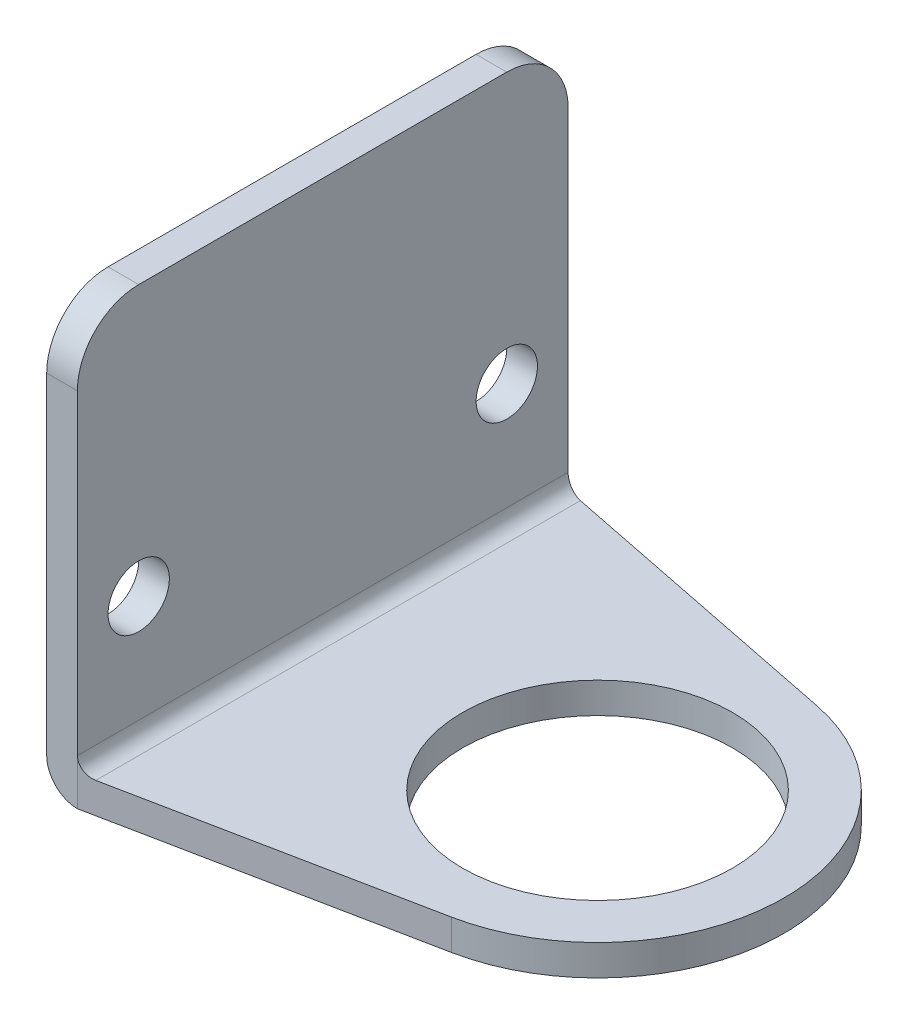
ISO-10303-21;
HEADER;
FILE_DESCRIPTION(('STEP AP214'),'2;1');
FILE_NAME('part.step','',(''),(''),'','','');
FILE_SCHEMA(('AUTOMOTIVE_DESIGN { 1 0 10303 214 1 1 1 1 }'));
ENDSEC;
DATA;
#1=APPLICATION_CONTEXT('core data for automotive mechanical design processes');
#2=APPLICATION_PROTOCOL_DEFINITION('international standard','automotive_design',2000,#1);
#3=PRODUCT_CONTEXT('',#1,'mechanical');
#4=PRODUCT('Part','Part','',(#3));
#5=PRODUCT_RELATED_PRODUCT_CATEGORY('part','',(#4));
#6=PRODUCT_DEFINITION_FORMATION('','',#4);
#7=PRODUCT_DEFINITION_CONTEXT('part definition',#1,'design');
#8=PRODUCT_DEFINITION('design','',#6,#7);
#9=PRODUCT_DEFINITION_SHAPE('','',#8);
#10=(LENGTH_UNIT() NAMED_UNIT(*) SI_UNIT(.MILLI.,.METRE.));
#11=(NAMED_UNIT(*) PLANE_ANGLE_UNIT() SI_UNIT($,.RADIAN.));
#12=(NAMED_UNIT(*) SI_UNIT($,.STERADIAN.) SOLID_ANGLE_UNIT());
#13=UNCERTAINTY_MEASURE_WITH_UNIT(LENGTH_MEASURE(1.E-05),#10,'distance_accuracy_value','');
#14=(GEOMETRIC_REPRESENTATION_CONTEXT(3) GLOBAL_UNCERTAINTY_ASSIGNED_CONTEXT((#13)) GLOBAL_UNIT_ASSIGNED_CONTEXT((#10,
#11,#12)) REPRESENTATION_CONTEXT('',''));
#15=CARTESIAN_POINT('',(0.,0.,0.));
#16=DIRECTION('',(0.,0.,1.));
#17=DIRECTION('',(1.,0.,0.));
#18=AXIS2_PLACEMENT_3D('',#15,#16,#17);
#19=CARTESIAN_POINT('',(0.,3.175,0.));
#20=DIRECTION('',(0.,1.,0.));
#21=DIRECTION('',(0.,0.,1.));
#22=AXIS2_PLACEMENT_3D('',#19,#20,#21);
#23=PLANE('',#22);
#24=CARTESIAN_POINT('',(0.,3.175,0.));
#25=DIRECTION('',(0.,1.,0.));
#26=DIRECTION('',(0.,0.,1.));
#27=AXIS2_PLACEMENT_3D('',#24,#25,#26);
#28=CIRCLE('',#27,13.97);
#29=CARTESIAN_POINT('',(0.,3.175,13.97));
#30=VERTEX_POINT('',#29);
#31=EDGE_CURVE('E238',#30,#30,#28,.T.);
#32=ORIENTED_EDGE('',*,*,#31,.F.);
#33=EDGE_LOOP('',(#32));
#34=FACE_BOUND('',#33,.T.);
#35=DIRECTION('',(0.980439451489967,0.,0.196820938830328));
#36=VECTOR('',#35,1.);
#37=CARTESIAN_POINT('',(3.79943140318066,3.175,-18.9264031715623));
#38=LINE('',#37,#36);
#39=CARTESIAN_POINT('',(-26.8605,3.175,-25.0813130684222));
#40=VERTEX_POINT('',#39);
#41=CARTESIAN_POINT('',(3.79943140318065,3.175,-18.9264031715623));
#42=VERTEX_POINT('',#41);
#43=EDGE_CURVE('E141',#40,#42,#38,.T.);
#44=ORIENTED_EDGE('',*,*,#43,.F.);
#45=DIRECTION('',(0.,0.,1.));
#46=VECTOR('',#45,1.);
#47=CARTESIAN_POINT('',(-26.8605,3.175,25.4));
#48=LINE('',#47,#46);
#49=CARTESIAN_POINT('',(-26.8605,3.175,25.0813130684222));
#50=VERTEX_POINT('',#49);
#51=EDGE_CURVE('E126',#40,#50,#48,.T.);
#52=ORIENTED_EDGE('',*,*,#51,.T.);
#53=DIRECTION('',(0.980439451489967,0.,-0.196820938830328));
#54=VECTOR('',#53,1.);
#55=CARTESIAN_POINT('',(3.79943140318065,3.175,18.9264031715623));
#56=LINE('',#55,#54);
#57=CARTESIAN_POINT('',(3.79943140318066,3.175,18.9264031715623));
#58=VERTEX_POINT('',#57);
#59=EDGE_CURVE('E120',#50,#58,#56,.T.);
#60=ORIENTED_EDGE('',*,*,#59,.T.);
#61=CARTESIAN_POINT('',(0.,3.175,0.));
#62=DIRECTION('',(0.,1.,0.));
#63=DIRECTION('',(0.,0.,1.));
#64=AXIS2_PLACEMENT_3D('',#61,#62,#63);
#65=CIRCLE('',#64,19.304);
#66=EDGE_CURVE('E123',#58,#42,#65,.T.);
#67=ORIENTED_EDGE('',*,*,#66,.T.);
#68=EDGE_LOOP('',(#44,#52,#60,#67));
#69=FACE_BOUND('',#68,.T.);
#70=ADVANCED_FACE('F41',(#34,#69),#23,.T.);
#71=CARTESIAN_POINT('',(3.79943140318065,3.175,18.9264031715623));
#72=DIRECTION('',(-0.196820938830328,0.,-0.980439451489967));
#73=DIRECTION('',(-0.980439451489967,0.,0.196820938830328));
#74=AXIS2_PLACEMENT_3D('',#71,#72,#73);
#75=PLANE('',#74);
#76=DIRECTION('',(0.980439451489967,0.,-0.196820938830328));
#77=VECTOR('',#76,1.);
#78=CARTESIAN_POINT('',(3.79943140318065,0.,18.9264031715623));
#79=LINE('',#78,#77);
#80=CARTESIAN_POINT('',(-28.448,0.,25.4));
#81=VERTEX_POINT('',#80);
#82=CARTESIAN_POINT('',(3.79943140318066,0.,18.9264031715623));
#83=VERTEX_POINT('',#82);
#84=EDGE_CURVE('E146',#81,#83,#79,.T.);
#85=ORIENTED_EDGE('',*,*,#84,.T.);
#86=DIRECTION('',(0.,-1.,0.));
#87=VECTOR('',#86,1.);
#88=CARTESIAN_POINT('',(3.79943140318066,3.175,18.9264031715623));
#89=LINE('',#88,#87);
#90=EDGE_CURVE('E137',#58,#83,#89,.T.);
#91=ORIENTED_EDGE('',*,*,#90,.F.);
#92=ORIENTED_EDGE('',*,*,#59,.F.);
#93=CARTESIAN_POINT('',(-26.8605,4.7625,25.0813130684222));
#94=DIRECTION('',(-0.196820938830328,0.,-0.980439451489967));
#95=DIRECTION('',(0.980439451489967,0.,-0.196820938830328));
#96=AXIS2_PLACEMENT_3D('',#93,#94,#95);
#97=ELLIPSE('',#96,1.61917189030642,1.5875);
#98=CARTESIAN_POINT('',(-28.448,4.7625,25.4));
#99=VERTEX_POINT('',#98);
#100=EDGE_CURVE('E160',#50,#99,#97,.T.);
#101=ORIENTED_EDGE('',*,*,#100,.T.);
#102=DIRECTION('',(0.,-1.,0.));
#103=VECTOR('',#102,1.);
#104=CARTESIAN_POINT('',(-28.448,3.175,25.4));
#105=LINE('',#104,#103);
#106=EDGE_CURVE('E228',#99,#81,#105,.T.);
#107=ORIENTED_EDGE('',*,*,#106,.T.);
#108=EDGE_LOOP('',(#85,#91,#92,#101,#107));
#109=FACE_BOUND('',#108,.T.);
#110=ADVANCED_FACE('F143',(#109),#75,.F.);
#111=CARTESIAN_POINT('',(0.,3.175,0.));
#112=DIRECTION('',(0.,-1.,0.));
#113=DIRECTION('',(0.,0.,-1.));
#114=AXIS2_PLACEMENT_3D('',#111,#112,#113);
#115=CYLINDRICAL_SURFACE('',#114,19.304);
#116=CARTESIAN_POINT('',(0.,0.,0.));
#117=DIRECTION('',(0.,1.,0.));
#118=DIRECTION('',(0.,0.,1.));
#119=AXIS2_PLACEMENT_3D('',#116,#117,#118);
#120=CIRCLE('',#119,19.304);
#121=CARTESIAN_POINT('',(3.79943140318065,0.,-18.9264031715623));
#122=VERTEX_POINT('',#121);
#123=EDGE_CURVE('E244',#83,#122,#120,.T.);
#124=ORIENTED_EDGE('',*,*,#123,.T.);
#125=DIRECTION('',(0.,-1.,0.));
#126=VECTOR('',#125,1.);
#127=CARTESIAN_POINT('',(3.79943140318065,3.175,-18.9264031715623));
#128=LINE('',#127,#126);
#129=EDGE_CURVE('E139',#42,#122,#128,.T.);
#130=ORIENTED_EDGE('',*,*,#129,.F.);
#131=ORIENTED_EDGE('',*,*,#66,.F.);
#132=ORIENTED_EDGE('',*,*,#90,.T.);
#133=EDGE_LOOP('',(#124,#130,#131,#132));
#134=FACE_BOUND('',#133,.T.);
#135=ADVANCED_FACE('F136',(#134),#115,.T.);
#136=CARTESIAN_POINT('',(3.79943140318066,3.175,-18.9264031715623));
#137=DIRECTION('',(0.196820938830328,0.,-0.980439451489967));
#138=DIRECTION('',(-0.980439451489968,0.,-0.196820938830328));
#139=AXIS2_PLACEMENT_3D('',#136,#137,#138);
#140=PLANE('',#139);
#141=DIRECTION('',(0.980439451489967,0.,0.196820938830328));
#142=VECTOR('',#141,1.);
#143=CARTESIAN_POINT('',(3.79943140318066,0.,-18.9264031715623));
#144=LINE('',#143,#142);
#145=CARTESIAN_POINT('',(-28.448,0.,-25.4));
#146=VERTEX_POINT('',#145);
#147=EDGE_CURVE('E247',#146,#122,#144,.T.);
#148=ORIENTED_EDGE('',*,*,#147,.F.);
#149=DIRECTION('',(0.,-1.,0.));
#150=VECTOR('',#149,1.);
#151=CARTESIAN_POINT('',(-28.448,3.175,-25.4));
#152=LINE('',#151,#150);
#153=CARTESIAN_POINT('',(-28.448,4.7625,-25.4));
#154=VERTEX_POINT('',#153);
#155=EDGE_CURVE('E153',#154,#146,#152,.T.);
#156=ORIENTED_EDGE('',*,*,#155,.F.);
#157=CARTESIAN_POINT('',(-26.8605,4.7625,-25.0813130684222));
#158=DIRECTION('',(0.196820938830328,0.,-0.980439451489967));
#159=DIRECTION('',(-0.980439451489968,0.,-0.196820938830328));
#160=AXIS2_PLACEMENT_3D('',#157,#158,#159);
#161=ELLIPSE('',#160,1.61917189030642,1.5875);
#162=EDGE_CURVE('E163',#154,#40,#161,.F.);
#163=ORIENTED_EDGE('',*,*,#162,.T.);
#164=ORIENTED_EDGE('',*,*,#43,.T.);
#165=ORIENTED_EDGE('',*,*,#129,.T.);
#166=EDGE_LOOP('',(#148,#156,#163,#164,#165));
#167=FACE_BOUND('',#166,.T.);
#168=ADVANCED_FACE('F270',(#167),#140,.T.);
#169=CARTESIAN_POINT('',(0.,3.175,-25.4));
#170=DIRECTION('',(0.,0.,1.));
#171=DIRECTION('',(1.,0.,0.));
#172=AXIS2_PLACEMENT_3D('',#169,#170,#171);
#173=PLANE('',#172);
#174=DIRECTION('',(0.,-1.,0.));
#175=VECTOR('',#174,1.);
#176=CARTESIAN_POINT('',(-31.623,3.175,-25.4));
#177=LINE('',#176,#175);
#178=CARTESIAN_POINT('',(-31.623,37.465,-25.4));
#179=VERTEX_POINT('',#178);
#180=CARTESIAN_POINT('',(-31.623,3.175,-25.4));
#181=VERTEX_POINT('',#180);
#182=EDGE_CURVE('E258',#179,#181,#177,.T.);
#183=ORIENTED_EDGE('',*,*,#182,.F.);
#184=DIRECTION('',(-1.,0.,0.));
#185=VECTOR('',#184,1.);
#186=CARTESIAN_POINT('',(-28.448,37.465,-25.4));
#187=LINE('',#186,#185);
#188=CARTESIAN_POINT('',(-28.448,37.465,-25.4));
#189=VERTEX_POINT('',#188);
#190=EDGE_CURVE('E11',#179,#189,#187,.F.);
#191=ORIENTED_EDGE('',*,*,#190,.T.);
#192=DIRECTION('',(0.,-1.,0.));
#193=VECTOR('',#192,1.);
#194=CARTESIAN_POINT('',(-28.448,43.815,-25.4));
#195=LINE('',#194,#193);
#196=EDGE_CURVE('E230',#189,#154,#195,.T.);
#197=ORIENTED_EDGE('',*,*,#196,.T.);
#198=ORIENTED_EDGE('',*,*,#155,.T.);
#199=CARTESIAN_POINT('',(-28.448,3.175,-25.4));
#200=DIRECTION('',(0.,0.,1.));
#201=DIRECTION('',(1.,0.,0.));
#202=AXIS2_PLACEMENT_3D('',#199,#200,#201);
#203=CIRCLE('',#202,3.175);
#204=EDGE_CURVE('E176',#146,#181,#203,.F.);
#205=ORIENTED_EDGE('',*,*,#204,.T.);
#206=EDGE_LOOP('',(#183,#191,#197,#198,#205));
#207=FACE_BOUND('',#206,.T.);
#208=ADVANCED_FACE('F265',(#207),#173,.F.);
#209=CARTESIAN_POINT('',(-31.623,3.175,0.));
#210=DIRECTION('',(1.,0.,0.));
#211=DIRECTION('',(0.,0.,-1.));
#212=AXIS2_PLACEMENT_3D('',#209,#210,#211);
#213=PLANE('',#212);
#214=CARTESIAN_POINT('',(-31.623,15.875,19.05));
#215=DIRECTION('',(-1.,0.,0.));
#216=DIRECTION('',(0.,0.,1.));
#217=AXIS2_PLACEMENT_3D('',#214,#215,#216);
#218=CIRCLE('',#217,3.175);
#219=CARTESIAN_POINT('',(-31.623,15.875,22.225));
#220=VERTEX_POINT('',#219);
#221=EDGE_CURVE('E186',#220,#220,#218,.T.);
#222=ORIENTED_EDGE('',*,*,#221,.F.);
#223=EDGE_LOOP('',(#222));
#224=FACE_BOUND('',#223,.T.);
#225=CARTESIAN_POINT('',(-31.623,15.875,-19.05));
#226=DIRECTION('',(-1.,0.,0.));
#227=DIRECTION('',(0.,0.,1.));
#228=AXIS2_PLACEMENT_3D('',#225,#226,#227);
#229=CIRCLE('',#228,3.175);
#230=CARTESIAN_POINT('',(-31.623,15.875,-15.875));
#231=VERTEX_POINT('',#230);
#232=EDGE_CURVE('E281',#231,#231,#229,.T.);
#233=ORIENTED_EDGE('',*,*,#232,.F.);
#234=EDGE_LOOP('',(#233));
#235=FACE_BOUND('',#234,.T.);
#236=DIRECTION('',(0.,-1.,0.));
#237=VECTOR('',#236,1.);
#238=CARTESIAN_POINT('',(-31.623,3.175,25.4));
#239=LINE('',#238,#237);
#240=CARTESIAN_POINT('',(-31.623,37.465,25.4));
#241=VERTEX_POINT('',#240);
#242=CARTESIAN_POINT('',(-31.623,3.175,25.4));
#243=VERTEX_POINT('',#242);
#244=EDGE_CURVE('E212',#241,#243,#239,.T.);
#245=ORIENTED_EDGE('',*,*,#244,.F.);
#246=CARTESIAN_POINT('',(-31.623,37.465,19.05));
#247=DIRECTION('',(1.,0.,0.));
#248=DIRECTION('',(0.,0.,-1.));
#249=AXIS2_PLACEMENT_3D('',#246,#247,#248);
#250=CIRCLE('',#249,6.35);
#251=CARTESIAN_POINT('',(-31.623,43.815,19.05));
#252=VERTEX_POINT('',#251);
#253=EDGE_CURVE('E50',#241,#252,#250,.F.);
#254=ORIENTED_EDGE('',*,*,#253,.T.);
#255=DIRECTION('',(0.,0.,1.));
#256=VECTOR('',#255,1.);
#257=CARTESIAN_POINT('',(-31.623,43.815,0.));
#258=LINE('',#257,#256);
#259=CARTESIAN_POINT('',(-31.623,43.815,-19.05));
#260=VERTEX_POINT('',#259);
#261=EDGE_CURVE('E211',#260,#252,#258,.T.);
#262=ORIENTED_EDGE('',*,*,#261,.F.);
#263=CARTESIAN_POINT('',(-31.623,37.465,-19.05));
#264=DIRECTION('',(1.,0.,0.));
#265=DIRECTION('',(0.,0.,-1.));
#266=AXIS2_PLACEMENT_3D('',#263,#264,#265);
#267=CIRCLE('',#266,6.35);
#268=EDGE_CURVE('E57',#260,#179,#267,.F.);
#269=ORIENTED_EDGE('',*,*,#268,.T.);
#270=ORIENTED_EDGE('',*,*,#182,.T.);
#271=DIRECTION('',(0.,0.,1.));
#272=VECTOR('',#271,1.);
#273=CARTESIAN_POINT('',(-31.623,3.175,0.));
#274=LINE('',#273,#272);
#275=EDGE_CURVE('E166',#181,#243,#274,.T.);
#276=ORIENTED_EDGE('',*,*,#275,.T.);
#277=EDGE_LOOP('',(#245,#254,#262,#269,#270,#276));
#278=FACE_BOUND('',#277,.T.);
#279=ADVANCED_FACE('F210',(#224,#235,#278),#213,.F.);
#280=CARTESIAN_POINT('',(0.,3.175,25.4));
#281=DIRECTION('',(0.,0.,1.));
#282=DIRECTION('',(1.,0.,0.));
#283=AXIS2_PLACEMENT_3D('',#280,#281,#282);
#284=PLANE('',#283);
#285=DIRECTION('',(0.,-1.,0.));
#286=VECTOR('',#285,1.);
#287=CARTESIAN_POINT('',(-28.448,43.815,25.4));
#288=LINE('',#287,#286);
#289=CARTESIAN_POINT('',(-28.448,37.465,25.4));
#290=VERTEX_POINT('',#289);
#291=EDGE_CURVE('E221',#290,#99,#288,.T.);
#292=ORIENTED_EDGE('',*,*,#291,.F.);
#293=DIRECTION('',(1.,0.,0.));
#294=VECTOR('',#293,1.);
#295=CARTESIAN_POINT('',(0.,37.465,25.4));
#296=LINE('',#295,#294);
#297=EDGE_CURVE('E65',#290,#241,#296,.F.);
#298=ORIENTED_EDGE('',*,*,#297,.T.);
#299=ORIENTED_EDGE('',*,*,#244,.T.);
#300=CARTESIAN_POINT('',(-28.448,3.175,25.4));
#301=DIRECTION('',(0.,0.,1.));
#302=DIRECTION('',(1.,0.,0.));
#303=AXIS2_PLACEMENT_3D('',#300,#301,#302);
#304=CIRCLE('',#303,3.175);
#305=EDGE_CURVE('E170',#243,#81,#304,.T.);
#306=ORIENTED_EDGE('',*,*,#305,.T.);
#307=ORIENTED_EDGE('',*,*,#106,.F.);
#308=EDGE_LOOP('',(#292,#298,#299,#306,#307));
#309=FACE_BOUND('',#308,.T.);
#310=ADVANCED_FACE('F227',(#309),#284,.T.);
#311=CARTESIAN_POINT('',(0.,3.175,0.));
#312=DIRECTION('',(0.,-1.,0.));
#313=DIRECTION('',(0.,0.,-1.));
#314=AXIS2_PLACEMENT_3D('',#311,#312,#313);
#315=CYLINDRICAL_SURFACE('',#314,13.97);
#316=ORIENTED_EDGE('',*,*,#31,.T.);
#317=EDGE_LOOP('',(#316));
#318=FACE_BOUND('',#317,.T.);
#319=CARTESIAN_POINT('',(0.,0.,0.));
#320=DIRECTION('',(0.,1.,0.));
#321=DIRECTION('',(0.,0.,1.));
#322=AXIS2_PLACEMENT_3D('',#319,#320,#321);
#323=CIRCLE('',#322,13.97);
#324=CARTESIAN_POINT('',(0.,0.,13.97));
#325=VERTEX_POINT('',#324);
#326=EDGE_CURVE('E131',#325,#325,#323,.T.);
#327=ORIENTED_EDGE('',*,*,#326,.F.);
#328=EDGE_LOOP('',(#327));
#329=FACE_BOUND('',#328,.T.);
#330=ADVANCED_FACE('F322',(#318,#329),#315,.F.);
#331=CARTESIAN_POINT('',(0.,0.,0.));
#332=DIRECTION('',(0.,1.,0.));
#333=DIRECTION('',(0.,0.,1.));
#334=AXIS2_PLACEMENT_3D('',#331,#332,#333);
#335=PLANE('',#334);
#336=ORIENTED_EDGE('',*,*,#84,.F.);
#337=DIRECTION('',(0.,0.,1.));
#338=VECTOR('',#337,1.);
#339=CARTESIAN_POINT('',(-28.448,0.,0.));
#340=LINE('',#339,#338);
#341=EDGE_CURVE('E173',#81,#146,#340,.F.);
#342=ORIENTED_EDGE('',*,*,#341,.T.);
#343=ORIENTED_EDGE('',*,*,#147,.T.);
#344=ORIENTED_EDGE('',*,*,#123,.F.);
#345=EDGE_LOOP('',(#336,#342,#343,#344));
#346=FACE_BOUND('',#345,.T.);
#347=ORIENTED_EDGE('',*,*,#326,.T.);
#348=EDGE_LOOP('',(#347));
#349=FACE_BOUND('',#348,.T.);
#350=ADVANCED_FACE('F319',(#346,#349),#335,.F.);
#351=CARTESIAN_POINT('',(-28.448,43.815,0.));
#352=DIRECTION('',(1.,0.,0.));
#353=DIRECTION('',(0.,0.,-1.));
#354=AXIS2_PLACEMENT_3D('',#351,#352,#353);
#355=PLANE('',#354);
#356=CARTESIAN_POINT('',(-28.448,15.875,19.05));
#357=DIRECTION('',(1.,0.,0.));
#358=DIRECTION('',(0.,0.,-1.));
#359=AXIS2_PLACEMENT_3D('',#356,#357,#358);
#360=CIRCLE('',#359,3.175);
#361=CARTESIAN_POINT('',(-28.448,15.875,15.875));
#362=VERTEX_POINT('',#361);
#363=EDGE_CURVE('E185',#362,#362,#360,.T.);
#364=ORIENTED_EDGE('',*,*,#363,.F.);
#365=EDGE_LOOP('',(#364));
#366=FACE_BOUND('',#365,.T.);
#367=CARTESIAN_POINT('',(-28.448,15.875,-19.05));
#368=DIRECTION('',(1.,0.,0.));
#369=DIRECTION('',(0.,0.,-1.));
#370=AXIS2_PLACEMENT_3D('',#367,#368,#369);
#371=CIRCLE('',#370,3.175);
#372=CARTESIAN_POINT('',(-28.448,15.875,-22.225));
#373=VERTEX_POINT('',#372);
#374=EDGE_CURVE('E181',#373,#373,#371,.T.);
#375=ORIENTED_EDGE('',*,*,#374,.F.);
#376=EDGE_LOOP('',(#375));
#377=FACE_BOUND('',#376,.T.);
#378=DIRECTION('',(0.,0.,1.));
#379=VECTOR('',#378,1.);
#380=CARTESIAN_POINT('',(-28.448,43.815,0.));
#381=LINE('',#380,#379);
#382=CARTESIAN_POINT('',(-28.448,43.815,-19.05));
#383=VERTEX_POINT('',#382);
#384=CARTESIAN_POINT('',(-28.448,43.815,19.05));
#385=VERTEX_POINT('',#384);
#386=EDGE_CURVE('E190',#383,#385,#381,.T.);
#387=ORIENTED_EDGE('',*,*,#386,.T.);
#388=CARTESIAN_POINT('',(-28.448,37.465,19.05));
#389=DIRECTION('',(1.,0.,0.));
#390=DIRECTION('',(0.,0.,-1.));
#391=AXIS2_PLACEMENT_3D('',#388,#389,#390);
#392=CIRCLE('',#391,6.35);
#393=EDGE_CURVE('E201',#385,#290,#392,.T.);
#394=ORIENTED_EDGE('',*,*,#393,.T.);
#395=ORIENTED_EDGE('',*,*,#291,.T.);
#396=DIRECTION('',(0.,0.,1.));
#397=VECTOR('',#396,1.);
#398=CARTESIAN_POINT('',(-28.448,4.7625,-25.4));
#399=LINE('',#398,#397);
#400=EDGE_CURVE('E151',#99,#154,#399,.F.);
#401=ORIENTED_EDGE('',*,*,#400,.T.);
#402=ORIENTED_EDGE('',*,*,#196,.F.);
#403=CARTESIAN_POINT('',(-28.448,37.465,-19.05));
#404=DIRECTION('',(1.,0.,0.));
#405=DIRECTION('',(0.,0.,-1.));
#406=AXIS2_PLACEMENT_3D('',#403,#404,#405);
#407=CIRCLE('',#406,6.35);
#408=EDGE_CURVE('E198',#189,#383,#407,.T.);
#409=ORIENTED_EDGE('',*,*,#408,.T.);
#410=EDGE_LOOP('',(#387,#394,#395,#401,#402,#409));
#411=FACE_BOUND('',#410,.T.);
#412=ADVANCED_FACE('F225',(#366,#377,#411),#355,.T.);
#413=CARTESIAN_POINT('',(0.,43.815,0.));
#414=DIRECTION('',(0.,1.,0.));
#415=DIRECTION('',(0.,0.,1.));
#416=AXIS2_PLACEMENT_3D('',#413,#414,#415);
#417=PLANE('',#416);
#418=ORIENTED_EDGE('',*,*,#261,.T.);
#419=DIRECTION('',(1.,0.,0.));
#420=VECTOR('',#419,1.);
#421=CARTESIAN_POINT('',(0.,43.815,19.05));
#422=LINE('',#421,#420);
#423=EDGE_CURVE('E194',#252,#385,#422,.T.);
#424=ORIENTED_EDGE('',*,*,#423,.T.);
#425=ORIENTED_EDGE('',*,*,#386,.F.);
#426=DIRECTION('',(-1.,0.,0.));
#427=VECTOR('',#426,1.);
#428=CARTESIAN_POINT('',(-31.623,43.815,-19.05));
#429=LINE('',#428,#427);
#430=EDGE_CURVE('E180',#383,#260,#429,.T.);
#431=ORIENTED_EDGE('',*,*,#430,.T.);
#432=EDGE_LOOP('',(#418,#424,#425,#431));
#433=FACE_BOUND('',#432,.T.);
#434=ADVANCED_FACE('F216',(#433),#417,.T.);
#435=CARTESIAN_POINT('',(-26.8605,4.7625,0.));
#436=DIRECTION('',(0.,0.,-1.));
#437=DIRECTION('',(-1.,0.,0.));
#438=AXIS2_PLACEMENT_3D('',#435,#436,#437);
#439=CYLINDRICAL_SURFACE('',#438,1.5875);
#440=ORIENTED_EDGE('',*,*,#162,.F.);
#441=ORIENTED_EDGE('',*,*,#400,.F.);
#442=ORIENTED_EDGE('',*,*,#100,.F.);
#443=ORIENTED_EDGE('',*,*,#51,.F.);
#444=EDGE_LOOP('',(#440,#441,#442,#443));
#445=FACE_BOUND('',#444,.T.);
#446=ADVANCED_FACE('F306',(#445),#439,.F.);
#447=CARTESIAN_POINT('',(-28.448,3.175,0.));
#448=DIRECTION('',(0.,0.,1.));
#449=DIRECTION('',(1.,0.,0.));
#450=AXIS2_PLACEMENT_3D('',#447,#448,#449);
#451=CYLINDRICAL_SURFACE('',#450,3.175);
#452=ORIENTED_EDGE('',*,*,#204,.F.);
#453=ORIENTED_EDGE('',*,*,#341,.F.);
#454=ORIENTED_EDGE('',*,*,#305,.F.);
#455=ORIENTED_EDGE('',*,*,#275,.F.);
#456=EDGE_LOOP('',(#452,#453,#454,#455));
#457=FACE_BOUND('',#456,.T.);
#458=ADVANCED_FACE('F274',(#457),#451,.T.);
#459=CARTESIAN_POINT('',(19.304,15.875,-19.05));
#460=DIRECTION('',(-1.,0.,0.));
#461=DIRECTION('',(0.,0.,1.));
#462=AXIS2_PLACEMENT_3D('',#459,#460,#461);
#463=CYLINDRICAL_SURFACE('',#462,3.175);
#464=ORIENTED_EDGE('',*,*,#374,.T.);
#465=EDGE_LOOP('',(#464));
#466=FACE_BOUND('',#465,.T.);
#467=ORIENTED_EDGE('',*,*,#232,.T.);
#468=EDGE_LOOP('',(#467));
#469=FACE_BOUND('',#468,.T.);
#470=ADVANCED_FACE('F296',(#466,#469),#463,.F.);
#471=CARTESIAN_POINT('',(19.304,15.875,19.05));
#472=DIRECTION('',(-1.,0.,0.));
#473=DIRECTION('',(0.,0.,1.));
#474=AXIS2_PLACEMENT_3D('',#471,#472,#473);
#475=CYLINDRICAL_SURFACE('',#474,3.175);
#476=ORIENTED_EDGE('',*,*,#363,.T.);
#477=EDGE_LOOP('',(#476));
#478=FACE_BOUND('',#477,.T.);
#479=ORIENTED_EDGE('',*,*,#221,.T.);
#480=EDGE_LOOP('',(#479));
#481=FACE_BOUND('',#480,.T.);
#482=ADVANCED_FACE('F289',(#478,#481),#475,.F.);
#483=CARTESIAN_POINT('',(0.,37.465,19.05));
#484=DIRECTION('',(1.,0.,0.));
#485=DIRECTION('',(0.,0.,-1.));
#486=AXIS2_PLACEMENT_3D('',#483,#484,#485);
#487=CYLINDRICAL_SURFACE('',#486,6.35);
#488=ORIENTED_EDGE('',*,*,#253,.F.);
#489=ORIENTED_EDGE('',*,*,#297,.F.);
#490=ORIENTED_EDGE('',*,*,#393,.F.);
#491=ORIENTED_EDGE('',*,*,#423,.F.);
#492=EDGE_LOOP('',(#488,#489,#490,#491));
#493=FACE_BOUND('',#492,.T.);
#494=ADVANCED_FACE('F223',(#493),#487,.T.);
#495=CARTESIAN_POINT('',(0.,37.465,-19.05));
#496=DIRECTION('',(1.,0.,0.));
#497=DIRECTION('',(0.,0.,-1.));
#498=AXIS2_PLACEMENT_3D('',#495,#496,#497);
#499=CYLINDRICAL_SURFACE('',#498,6.35);
#500=ORIENTED_EDGE('',*,*,#408,.F.);
#501=ORIENTED_EDGE('',*,*,#190,.F.);
#502=ORIENTED_EDGE('',*,*,#268,.F.);
#503=ORIENTED_EDGE('',*,*,#430,.F.);
#504=EDGE_LOOP('',(#500,#501,#502,#503));
#505=FACE_BOUND('',#504,.T.);
#506=ADVANCED_FACE('F43',(#505),#499,.T.);
#507=CLOSED_SHELL('',(#70,#110,#135,#168,#208,#279,#310,#330,#350,#412,#434,#446,#458,#470,#482,
#494,#506));
#508=MANIFOLD_SOLID_BREP('B2',#507);
#509=ADVANCED_BREP_SHAPE_REPRESENTATION('',(#18,#508),#14);
#510=SHAPE_DEFINITION_REPRESENTATION(#9,#509);
ENDSEC;
END-ISO-10303-21;
